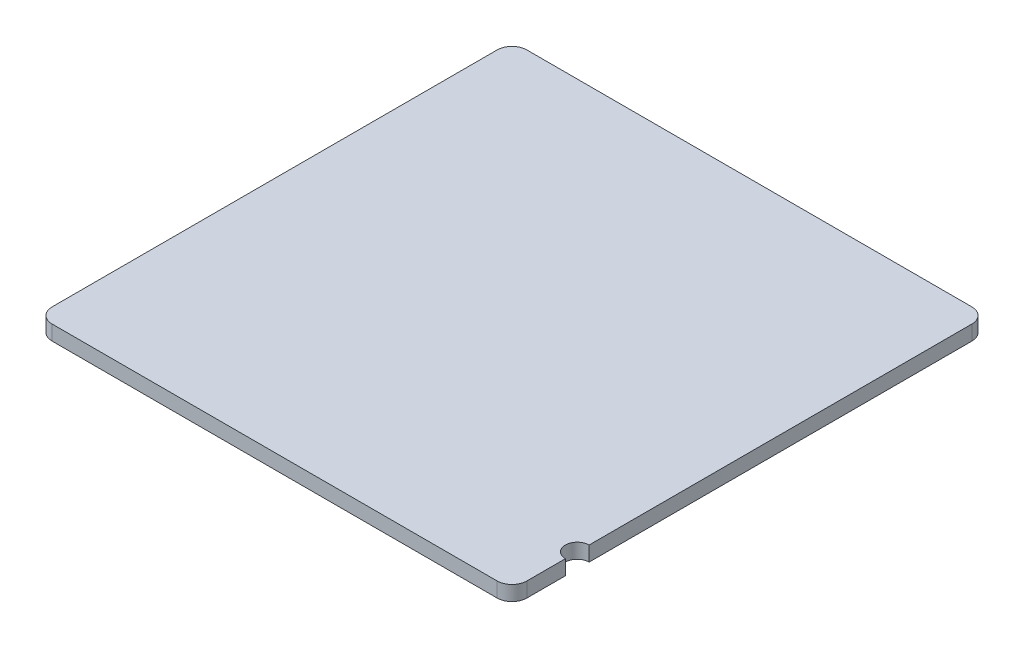
ISO-10303-21;
HEADER;
FILE_DESCRIPTION(('STEP AP214'),'2;1');
FILE_NAME('part.step','',(''),(''),'','','');
FILE_SCHEMA(('AUTOMOTIVE_DESIGN { 1 0 10303 214 1 1 1 1 }'));
ENDSEC;
DATA;
#1=APPLICATION_CONTEXT('core data for automotive mechanical design processes');
#2=APPLICATION_PROTOCOL_DEFINITION('international standard','automotive_design',2000,#1);
#3=PRODUCT_CONTEXT('',#1,'mechanical');
#4=PRODUCT('Part','Part','',(#3));
#5=PRODUCT_RELATED_PRODUCT_CATEGORY('part','',(#4));
#6=PRODUCT_DEFINITION_FORMATION('','',#4);
#7=PRODUCT_DEFINITION_CONTEXT('part definition',#1,'design');
#8=PRODUCT_DEFINITION('design','',#6,#7);
#9=PRODUCT_DEFINITION_SHAPE('','',#8);
#10=(LENGTH_UNIT() NAMED_UNIT(*) SI_UNIT(.MILLI.,.METRE.));
#11=(NAMED_UNIT(*) PLANE_ANGLE_UNIT() SI_UNIT($,.RADIAN.));
#12=(NAMED_UNIT(*) SI_UNIT($,.STERADIAN.) SOLID_ANGLE_UNIT());
#13=UNCERTAINTY_MEASURE_WITH_UNIT(LENGTH_MEASURE(1.E-05),#10,'distance_accuracy_value','');
#14=(GEOMETRIC_REPRESENTATION_CONTEXT(3) GLOBAL_UNCERTAINTY_ASSIGNED_CONTEXT((#13)) GLOBAL_UNIT_ASSIGNED_CONTEXT((#10,
#11,#12)) REPRESENTATION_CONTEXT('',''));
#15=CARTESIAN_POINT('',(0.,0.,0.));
#16=DIRECTION('',(0.,0.,1.));
#17=DIRECTION('',(1.,0.,0.));
#18=AXIS2_PLACEMENT_3D('',#15,#16,#17);
#19=CARTESIAN_POINT('',(-0.75,-0.3,0.75));
#20=DIRECTION('',(0.,-1.,0.));
#21=DIRECTION('',(0.,0.,-1.));
#22=AXIS2_PLACEMENT_3D('',#19,#20,#21);
#23=CYLINDRICAL_SURFACE('',#22,0.05);
#24=CARTESIAN_POINT('',(-0.75,-0.35,0.75));
#25=DIRECTION('',(0.,-1.,0.));
#26=DIRECTION('',(0.,0.,-1.));
#27=AXIS2_PLACEMENT_3D('',#24,#25,#26);
#28=CIRCLE('',#27,0.05);
#29=CARTESIAN_POINT('',(-0.75,-0.35,0.8));
#30=VERTEX_POINT('',#29);
#31=CARTESIAN_POINT('',(-0.800000000000001,-0.35,0.749999999999999));
#32=VERTEX_POINT('',#31);
#33=EDGE_CURVE('E11',#30,#32,#28,.T.);
#34=ORIENTED_EDGE('',*,*,#33,.F.);
#35=DIRECTION('',(0.,-1.,0.));
#36=VECTOR('',#35,1.);
#37=CARTESIAN_POINT('',(-0.75,-0.3,0.8));
#38=LINE('',#37,#36);
#39=CARTESIAN_POINT('',(-0.75,-0.3,0.8));
#40=VERTEX_POINT('',#39);
#41=EDGE_CURVE('E24',#40,#30,#38,.T.);
#42=ORIENTED_EDGE('',*,*,#41,.F.);
#43=CARTESIAN_POINT('',(-0.75,-0.3,0.75));
#44=DIRECTION('',(0.,-1.,0.));
#45=DIRECTION('',(0.,0.,-1.));
#46=AXIS2_PLACEMENT_3D('',#43,#44,#45);
#47=CIRCLE('',#46,0.05);
#48=CARTESIAN_POINT('',(-0.800000000000001,-0.3,0.749999999999999));
#49=VERTEX_POINT('',#48);
#50=EDGE_CURVE('E178',#40,#49,#47,.T.);
#51=ORIENTED_EDGE('',*,*,#50,.T.);
#52=DIRECTION('',(0.,-1.,0.));
#53=VECTOR('',#52,1.);
#54=CARTESIAN_POINT('',(-0.800000000000001,-0.3,0.749999999999999));
#55=LINE('',#54,#53);
#56=EDGE_CURVE('E114',#49,#32,#55,.T.);
#57=ORIENTED_EDGE('',*,*,#56,.T.);
#58=EDGE_LOOP('',(#34,#42,#51,#57));
#59=FACE_BOUND('',#58,.T.);
#60=ADVANCED_FACE('F17',(#59),#23,.T.);
#61=CARTESIAN_POINT('',(-0.75,-0.3,0.8));
#62=DIRECTION('',(0.,0.,1.));
#63=DIRECTION('',(1.,0.,0.));
#64=AXIS2_PLACEMENT_3D('',#61,#62,#63);
#65=PLANE('',#64);
#66=DIRECTION('',(-1.,0.,0.));
#67=VECTOR('',#66,1.);
#68=CARTESIAN_POINT('',(-0.75,-0.35,0.8));
#69=LINE('',#68,#67);
#70=CARTESIAN_POINT('',(0.749999999999999,-0.35,0.8));
#71=VERTEX_POINT('',#70);
#72=EDGE_CURVE('E175',#71,#30,#69,.T.);
#73=ORIENTED_EDGE('',*,*,#72,.F.);
#74=DIRECTION('',(0.,-1.,0.));
#75=VECTOR('',#74,1.);
#76=CARTESIAN_POINT('',(0.749999999999999,-0.3,0.8));
#77=LINE('',#76,#75);
#78=CARTESIAN_POINT('',(0.749999999999999,-0.3,0.8));
#79=VERTEX_POINT('',#78);
#80=EDGE_CURVE('E172',#79,#71,#77,.T.);
#81=ORIENTED_EDGE('',*,*,#80,.F.);
#82=DIRECTION('',(-1.,0.,0.));
#83=VECTOR('',#82,1.);
#84=CARTESIAN_POINT('',(-0.75,-0.3,0.8));
#85=LINE('',#84,#83);
#86=EDGE_CURVE('E169',#79,#40,#85,.T.);
#87=ORIENTED_EDGE('',*,*,#86,.T.);
#88=ORIENTED_EDGE('',*,*,#41,.T.);
#89=EDGE_LOOP('',(#73,#81,#87,#88));
#90=FACE_BOUND('',#89,.T.);
#91=ADVANCED_FACE('F180',(#90),#65,.T.);
#92=CARTESIAN_POINT('',(0.75,-0.3,0.75));
#93=DIRECTION('',(0.,-1.,0.));
#94=DIRECTION('',(0.,0.,-1.));
#95=AXIS2_PLACEMENT_3D('',#92,#93,#94);
#96=CYLINDRICAL_SURFACE('',#95,0.05);
#97=CARTESIAN_POINT('',(0.75,-0.35,0.75));
#98=DIRECTION('',(0.,-1.,0.));
#99=DIRECTION('',(0.,0.,1.));
#100=AXIS2_PLACEMENT_3D('',#97,#98,#99);
#101=CIRCLE('',#100,0.05);
#102=CARTESIAN_POINT('',(0.8,-0.35,0.749999999999999));
#103=VERTEX_POINT('',#102);
#104=EDGE_CURVE('E166',#103,#71,#101,.T.);
#105=ORIENTED_EDGE('',*,*,#104,.F.);
#106=DIRECTION('',(0.,-1.,0.));
#107=VECTOR('',#106,1.);
#108=CARTESIAN_POINT('',(0.8,-0.3,0.749999999999999));
#109=LINE('',#108,#107);
#110=CARTESIAN_POINT('',(0.8,-0.3,0.749999999999999));
#111=VERTEX_POINT('',#110);
#112=EDGE_CURVE('E163',#111,#103,#109,.T.);
#113=ORIENTED_EDGE('',*,*,#112,.F.);
#114=CARTESIAN_POINT('',(0.75,-0.3,0.75));
#115=DIRECTION('',(0.,-1.,0.));
#116=DIRECTION('',(0.,0.,1.));
#117=AXIS2_PLACEMENT_3D('',#114,#115,#116);
#118=CIRCLE('',#117,0.05);
#119=EDGE_CURVE('E160',#111,#79,#118,.T.);
#120=ORIENTED_EDGE('',*,*,#119,.T.);
#121=ORIENTED_EDGE('',*,*,#80,.T.);
#122=EDGE_LOOP('',(#105,#113,#120,#121));
#123=FACE_BOUND('',#122,.T.);
#124=ADVANCED_FACE('F184',(#123),#96,.T.);
#125=CARTESIAN_POINT('',(0.8,-0.3,0.749999999999999));
#126=DIRECTION('',(1.,0.,0.));
#127=DIRECTION('',(0.,0.,-1.));
#128=AXIS2_PLACEMENT_3D('',#125,#126,#127);
#129=PLANE('',#128);
#130=DIRECTION('',(0.,0.,1.));
#131=VECTOR('',#130,1.);
#132=CARTESIAN_POINT('',(0.8,-0.35,0.749999999999999));
#133=LINE('',#132,#131);
#134=CARTESIAN_POINT('',(0.8,-0.35,0.62));
#135=VERTEX_POINT('',#134);
#136=EDGE_CURVE('E157',#135,#103,#133,.T.);
#137=ORIENTED_EDGE('',*,*,#136,.F.);
#138=DIRECTION('',(0.,-1.,0.));
#139=VECTOR('',#138,1.);
#140=CARTESIAN_POINT('',(0.8,-0.3,0.62));
#141=LINE('',#140,#139);
#142=CARTESIAN_POINT('',(0.8,-0.3,0.62));
#143=VERTEX_POINT('',#142);
#144=EDGE_CURVE('E154',#143,#135,#141,.T.);
#145=ORIENTED_EDGE('',*,*,#144,.F.);
#146=DIRECTION('',(0.,0.,1.));
#147=VECTOR('',#146,1.);
#148=CARTESIAN_POINT('',(0.8,-0.3,0.749999999999999));
#149=LINE('',#148,#147);
#150=EDGE_CURVE('E151',#143,#111,#149,.T.);
#151=ORIENTED_EDGE('',*,*,#150,.T.);
#152=ORIENTED_EDGE('',*,*,#112,.T.);
#153=EDGE_LOOP('',(#137,#145,#151,#152));
#154=FACE_BOUND('',#153,.T.);
#155=ADVANCED_FACE('F187',(#154),#129,.T.);
#156=CARTESIAN_POINT('',(0.8,-0.3,0.58));
#157=DIRECTION('',(0.,-1.,0.));
#158=DIRECTION('',(0.,0.,-1.));
#159=AXIS2_PLACEMENT_3D('',#156,#157,#158);
#160=CYLINDRICAL_SURFACE('',#159,0.04);
#161=CARTESIAN_POINT('',(0.8,-0.35,0.58));
#162=DIRECTION('',(0.,1.,0.));
#163=DIRECTION('',(0.,0.,-1.));
#164=AXIS2_PLACEMENT_3D('',#161,#162,#163);
#165=CIRCLE('',#164,0.04);
#166=CARTESIAN_POINT('',(0.8,-0.35,0.54));
#167=VERTEX_POINT('',#166);
#168=EDGE_CURVE('E148',#167,#135,#165,.T.);
#169=ORIENTED_EDGE('',*,*,#168,.F.);
#170=DIRECTION('',(0.,-1.,0.));
#171=VECTOR('',#170,1.);
#172=CARTESIAN_POINT('',(0.8,-0.3,0.54));
#173=LINE('',#172,#171);
#174=CARTESIAN_POINT('',(0.8,-0.3,0.54));
#175=VERTEX_POINT('',#174);
#176=EDGE_CURVE('E146',#175,#167,#173,.T.);
#177=ORIENTED_EDGE('',*,*,#176,.F.);
#178=CARTESIAN_POINT('',(0.8,-0.3,0.58));
#179=DIRECTION('',(0.,1.,0.));
#180=DIRECTION('',(0.,0.,-1.));
#181=AXIS2_PLACEMENT_3D('',#178,#179,#180);
#182=CIRCLE('',#181,0.04);
#183=EDGE_CURVE('E143',#175,#143,#182,.T.);
#184=ORIENTED_EDGE('',*,*,#183,.T.);
#185=ORIENTED_EDGE('',*,*,#144,.T.);
#186=EDGE_LOOP('',(#169,#177,#184,#185));
#187=FACE_BOUND('',#186,.T.);
#188=ADVANCED_FACE('F193',(#187),#160,.F.);
#189=CARTESIAN_POINT('',(0.8,-0.3,0.54));
#190=DIRECTION('',(1.,0.,0.));
#191=DIRECTION('',(0.,0.,-1.));
#192=AXIS2_PLACEMENT_3D('',#189,#190,#191);
#193=PLANE('',#192);
#194=DIRECTION('',(0.,0.,1.));
#195=VECTOR('',#194,1.);
#196=CARTESIAN_POINT('',(0.8,-0.35,0.54));
#197=LINE('',#196,#195);
#198=CARTESIAN_POINT('',(0.8,-0.35,-0.75));
#199=VERTEX_POINT('',#198);
#200=EDGE_CURVE('E140',#199,#167,#197,.T.);
#201=ORIENTED_EDGE('',*,*,#200,.F.);
#202=DIRECTION('',(0.,-1.,0.));
#203=VECTOR('',#202,1.);
#204=CARTESIAN_POINT('',(0.8,-0.3,-0.75));
#205=LINE('',#204,#203);
#206=CARTESIAN_POINT('',(0.8,-0.3,-0.75));
#207=VERTEX_POINT('',#206);
#208=EDGE_CURVE('E137',#207,#199,#205,.T.);
#209=ORIENTED_EDGE('',*,*,#208,.F.);
#210=DIRECTION('',(0.,0.,1.));
#211=VECTOR('',#210,1.);
#212=CARTESIAN_POINT('',(0.8,-0.3,0.54));
#213=LINE('',#212,#211);
#214=EDGE_CURVE('E134',#207,#175,#213,.T.);
#215=ORIENTED_EDGE('',*,*,#214,.T.);
#216=ORIENTED_EDGE('',*,*,#176,.T.);
#217=EDGE_LOOP('',(#201,#209,#215,#216));
#218=FACE_BOUND('',#217,.T.);
#219=ADVANCED_FACE('F195',(#218),#193,.T.);
#220=CARTESIAN_POINT('',(0.75,-0.3,-0.75));
#221=DIRECTION('',(0.,-1.,0.));
#222=DIRECTION('',(0.,0.,-1.));
#223=AXIS2_PLACEMENT_3D('',#220,#221,#222);
#224=CYLINDRICAL_SURFACE('',#223,0.05);
#225=CARTESIAN_POINT('',(0.75,-0.35,-0.75));
#226=DIRECTION('',(0.,-1.,0.));
#227=DIRECTION('',(0.,0.,-1.));
#228=AXIS2_PLACEMENT_3D('',#225,#226,#227);
#229=CIRCLE('',#228,0.05);
#230=CARTESIAN_POINT('',(0.749999999999999,-0.35,-0.8));
#231=VERTEX_POINT('',#230);
#232=EDGE_CURVE('E131',#231,#199,#229,.T.);
#233=ORIENTED_EDGE('',*,*,#232,.F.);
#234=DIRECTION('',(0.,-1.,0.));
#235=VECTOR('',#234,1.);
#236=CARTESIAN_POINT('',(0.749999999999999,-0.3,-0.8));
#237=LINE('',#236,#235);
#238=CARTESIAN_POINT('',(0.749999999999999,-0.3,-0.8));
#239=VERTEX_POINT('',#238);
#240=EDGE_CURVE('E128',#239,#231,#237,.T.);
#241=ORIENTED_EDGE('',*,*,#240,.F.);
#242=CARTESIAN_POINT('',(0.75,-0.3,-0.75));
#243=DIRECTION('',(0.,-1.,0.));
#244=DIRECTION('',(0.,0.,-1.));
#245=AXIS2_PLACEMENT_3D('',#242,#243,#244);
#246=CIRCLE('',#245,0.05);
#247=EDGE_CURVE('E125',#239,#207,#246,.T.);
#248=ORIENTED_EDGE('',*,*,#247,.T.);
#249=ORIENTED_EDGE('',*,*,#208,.T.);
#250=EDGE_LOOP('',(#233,#241,#248,#249));
#251=FACE_BOUND('',#250,.T.);
#252=ADVANCED_FACE('F197',(#251),#224,.T.);
#253=CARTESIAN_POINT('',(-0.75,-0.3,-0.8));
#254=DIRECTION('',(0.,0.,-1.));
#255=DIRECTION('',(-1.,0.,0.));
#256=AXIS2_PLACEMENT_3D('',#253,#254,#255);
#257=PLANE('',#256);
#258=DIRECTION('',(1.,0.,0.));
#259=VECTOR('',#258,1.);
#260=CARTESIAN_POINT('',(-0.75,-0.35,-0.8));
#261=LINE('',#260,#259);
#262=CARTESIAN_POINT('',(-0.75,-0.35,-0.8));
#263=VERTEX_POINT('',#262);
#264=EDGE_CURVE('E122',#263,#231,#261,.T.);
#265=ORIENTED_EDGE('',*,*,#264,.F.);
#266=DIRECTION('',(0.,-1.,0.));
#267=VECTOR('',#266,1.);
#268=CARTESIAN_POINT('',(-0.75,-0.3,-0.8));
#269=LINE('',#268,#267);
#270=CARTESIAN_POINT('',(-0.75,-0.3,-0.8));
#271=VERTEX_POINT('',#270);
#272=EDGE_CURVE('E120',#271,#263,#269,.T.);
#273=ORIENTED_EDGE('',*,*,#272,.F.);
#274=DIRECTION('',(1.,0.,0.));
#275=VECTOR('',#274,1.);
#276=CARTESIAN_POINT('',(-0.75,-0.3,-0.8));
#277=LINE('',#276,#275);
#278=EDGE_CURVE('E109',#271,#239,#277,.T.);
#279=ORIENTED_EDGE('',*,*,#278,.T.);
#280=ORIENTED_EDGE('',*,*,#240,.T.);
#281=EDGE_LOOP('',(#265,#273,#279,#280));
#282=FACE_BOUND('',#281,.T.);
#283=ADVANCED_FACE('F199',(#282),#257,.T.);
#284=CARTESIAN_POINT('',(-0.75,-0.3,-0.75));
#285=DIRECTION('',(0.,-1.,0.));
#286=DIRECTION('',(0.,0.,-1.));
#287=AXIS2_PLACEMENT_3D('',#284,#285,#286);
#288=CYLINDRICAL_SURFACE('',#287,0.05);
#289=CARTESIAN_POINT('',(-0.75,-0.35,-0.75));
#290=DIRECTION('',(0.,-1.,0.));
#291=DIRECTION('',(0.,0.,-1.));
#292=AXIS2_PLACEMENT_3D('',#289,#290,#291);
#293=CIRCLE('',#292,0.05);
#294=CARTESIAN_POINT('',(-0.8,-0.35,-0.75));
#295=VERTEX_POINT('',#294);
#296=EDGE_CURVE('E96',#295,#263,#293,.T.);
#297=ORIENTED_EDGE('',*,*,#296,.F.);
#298=DIRECTION('',(0.,-1.,0.));
#299=VECTOR('',#298,1.);
#300=CARTESIAN_POINT('',(-0.8,-0.3,-0.75));
#301=LINE('',#300,#299);
#302=CARTESIAN_POINT('',(-0.8,-0.3,-0.75));
#303=VERTEX_POINT('',#302);
#304=EDGE_CURVE('E90',#303,#295,#301,.T.);
#305=ORIENTED_EDGE('',*,*,#304,.F.);
#306=CARTESIAN_POINT('',(-0.75,-0.3,-0.75));
#307=DIRECTION('',(0.,-1.,0.));
#308=DIRECTION('',(0.,0.,-1.));
#309=AXIS2_PLACEMENT_3D('',#306,#307,#308);
#310=CIRCLE('',#309,0.05);
#311=EDGE_CURVE('E94',#303,#271,#310,.T.);
#312=ORIENTED_EDGE('',*,*,#311,.T.);
#313=ORIENTED_EDGE('',*,*,#272,.T.);
#314=EDGE_LOOP('',(#297,#305,#312,#313));
#315=FACE_BOUND('',#314,.T.);
#316=ADVANCED_FACE('F92',(#315),#288,.T.);
#317=CARTESIAN_POINT('',(-0.800000000000001,-0.3,0.749999999999999));
#318=DIRECTION('',(-1.,0.,0.));
#319=DIRECTION('',(0.,0.,1.));
#320=AXIS2_PLACEMENT_3D('',#317,#318,#319);
#321=PLANE('',#320);
#322=DIRECTION('',(0.,0.,-1.));
#323=VECTOR('',#322,1.);
#324=CARTESIAN_POINT('',(-0.800000000000001,-0.35,0.749999999999999));
#325=LINE('',#324,#323);
#326=EDGE_CURVE('E110',#32,#295,#325,.T.);
#327=ORIENTED_EDGE('',*,*,#326,.F.);
#328=ORIENTED_EDGE('',*,*,#56,.F.);
#329=DIRECTION('',(0.,0.,-1.));
#330=VECTOR('',#329,1.);
#331=CARTESIAN_POINT('',(-0.800000000000001,-0.3,0.749999999999999));
#332=LINE('',#331,#330);
#333=EDGE_CURVE('E106',#49,#303,#332,.T.);
#334=ORIENTED_EDGE('',*,*,#333,.T.);
#335=ORIENTED_EDGE('',*,*,#304,.T.);
#336=EDGE_LOOP('',(#327,#328,#334,#335));
#337=FACE_BOUND('',#336,.T.);
#338=ADVANCED_FACE('F113',(#337),#321,.T.);
#339=CARTESIAN_POINT('',(-0.75,-0.3,0.75));
#340=DIRECTION('',(0.,-1.,0.));
#341=DIRECTION('',(0.,0.,-1.));
#342=AXIS2_PLACEMENT_3D('',#339,#340,#341);
#343=PLANE('',#342);
#344=ORIENTED_EDGE('',*,*,#50,.F.);
#345=ORIENTED_EDGE('',*,*,#86,.F.);
#346=ORIENTED_EDGE('',*,*,#119,.F.);
#347=ORIENTED_EDGE('',*,*,#150,.F.);
#348=ORIENTED_EDGE('',*,*,#183,.F.);
#349=ORIENTED_EDGE('',*,*,#214,.F.);
#350=ORIENTED_EDGE('',*,*,#247,.F.);
#351=ORIENTED_EDGE('',*,*,#278,.F.);
#352=ORIENTED_EDGE('',*,*,#311,.F.);
#353=ORIENTED_EDGE('',*,*,#333,.F.);
#354=EDGE_LOOP('',(#344,#345,#346,#347,#348,#349,#350,#351,#352,#353));
#355=FACE_BOUND('',#354,.T.);
#356=ADVANCED_FACE('F105',(#355),#343,.F.);
#357=CARTESIAN_POINT('',(-0.75,-0.35,0.75));
#358=DIRECTION('',(0.,-1.,0.));
#359=DIRECTION('',(0.,0.,-1.));
#360=AXIS2_PLACEMENT_3D('',#357,#358,#359);
#361=PLANE('',#360);
#362=ORIENTED_EDGE('',*,*,#33,.T.);
#363=ORIENTED_EDGE('',*,*,#326,.T.);
#364=ORIENTED_EDGE('',*,*,#296,.T.);
#365=ORIENTED_EDGE('',*,*,#264,.T.);
#366=ORIENTED_EDGE('',*,*,#232,.T.);
#367=ORIENTED_EDGE('',*,*,#200,.T.);
#368=ORIENTED_EDGE('',*,*,#168,.T.);
#369=ORIENTED_EDGE('',*,*,#136,.T.);
#370=ORIENTED_EDGE('',*,*,#104,.T.);
#371=ORIENTED_EDGE('',*,*,#72,.T.);
#372=EDGE_LOOP('',(#362,#363,#364,#365,#366,#367,#368,#369,#370,#371));
#373=FACE_BOUND('',#372,.T.);
#374=ADVANCED_FACE('F182',(#373),#361,.T.);
#375=CLOSED_SHELL('',(#60,#91,#124,#155,#188,#219,#252,#283,#316,#338,#356,#374));
#376=MANIFOLD_SOLID_BREP('B1',#375);
#377=ADVANCED_BREP_SHAPE_REPRESENTATION('',(#18,#376),#14);
#378=SHAPE_DEFINITION_REPRESENTATION(#9,#377);
ENDSEC;
END-ISO-10303-21;
